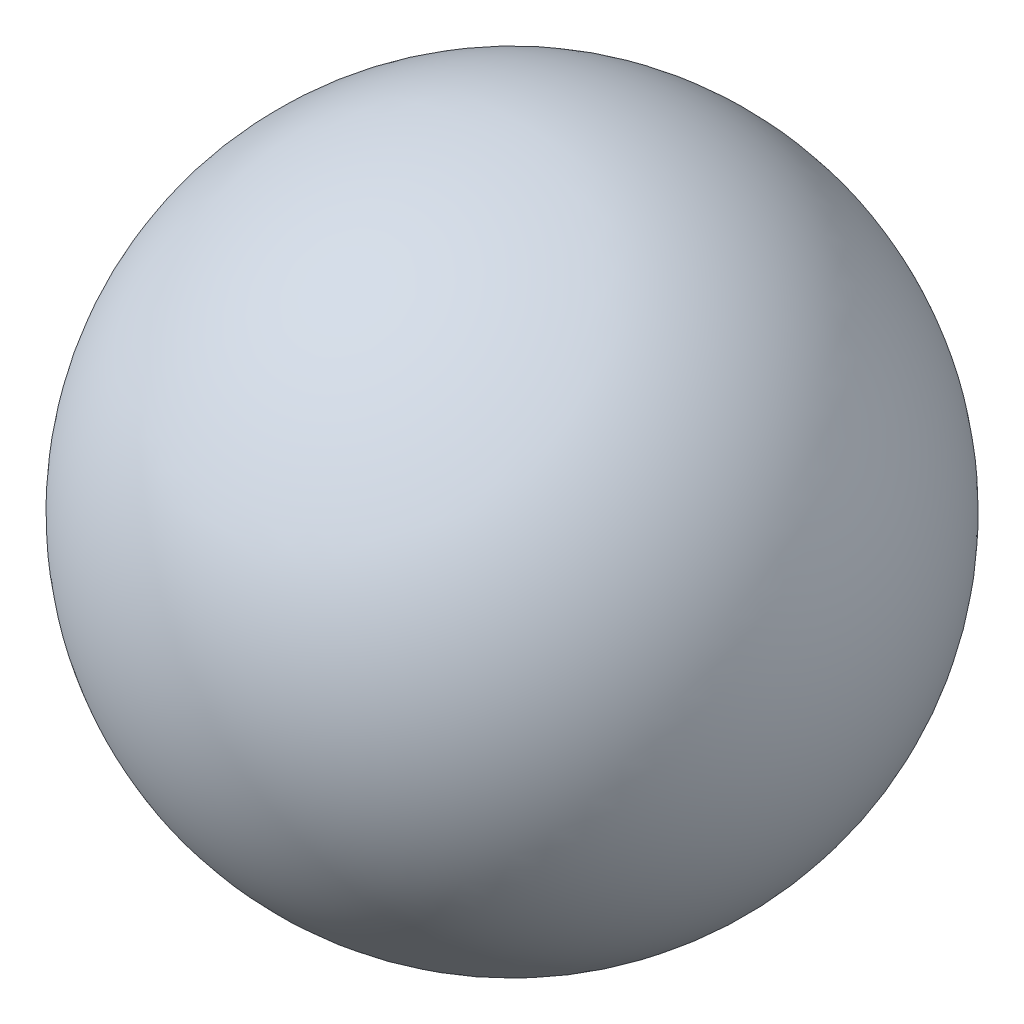
ISO-10303-21;
HEADER;
FILE_DESCRIPTION(('STEP AP214'),'2;1');
FILE_NAME('part.step','',(''),(''),'','','');
FILE_SCHEMA(('AUTOMOTIVE_DESIGN { 1 0 10303 214 1 1 1 1 }'));
ENDSEC;
DATA;
#1=APPLICATION_CONTEXT('core data for automotive mechanical design processes');
#2=APPLICATION_PROTOCOL_DEFINITION('international standard','automotive_design',2000,#1);
#3=PRODUCT_CONTEXT('',#1,'mechanical');
#4=PRODUCT('Part','Part','',(#3));
#5=PRODUCT_RELATED_PRODUCT_CATEGORY('part','',(#4));
#6=PRODUCT_DEFINITION_FORMATION('','',#4);
#7=PRODUCT_DEFINITION_CONTEXT('part definition',#1,'design');
#8=PRODUCT_DEFINITION('design','',#6,#7);
#9=PRODUCT_DEFINITION_SHAPE('','',#8);
#10=(LENGTH_UNIT() NAMED_UNIT(*) SI_UNIT(.MILLI.,.METRE.));
#11=(NAMED_UNIT(*) PLANE_ANGLE_UNIT() SI_UNIT($,.RADIAN.));
#12=(NAMED_UNIT(*) SI_UNIT($,.STERADIAN.) SOLID_ANGLE_UNIT());
#13=UNCERTAINTY_MEASURE_WITH_UNIT(LENGTH_MEASURE(1.E-05),#10,'distance_accuracy_value','');
#14=(GEOMETRIC_REPRESENTATION_CONTEXT(3) GLOBAL_UNCERTAINTY_ASSIGNED_CONTEXT((#13)) GLOBAL_UNIT_ASSIGNED_CONTEXT((#10,
#11,#12)) REPRESENTATION_CONTEXT('',''));
#15=CARTESIAN_POINT('',(0.,0.,0.));
#16=DIRECTION('',(0.,0.,1.));
#17=DIRECTION('',(1.,0.,0.));
#18=AXIS2_PLACEMENT_3D('',#15,#16,#17);
#19=CARTESIAN_POINT('',(0.,0.,0.));
#20=DIRECTION('',(0.,0.,1.));
#21=DIRECTION('',(-1.,0.,0.));
#22=AXIS2_PLACEMENT_3D('',#19,#20,#21);
#23=SPHERICAL_SURFACE('',#22,60.);
#24=CARTESIAN_POINT('',(0.,0.,60.));
#25=VERTEX_POINT('',#24);
#26=VERTEX_LOOP('',#25);
#27=FACE_BOUND('',#26,.T.);
#28=ADVANCED_FACE('F12',(#27),#23,.T.);
#29=CLOSED_SHELL('',(#28));
#30=CARTESIAN_POINT('',(0.,0.,0.));
#31=DIRECTION('',(0.,0.,1.));
#32=DIRECTION('',(-1.,0.,0.));
#33=AXIS2_PLACEMENT_3D('',#30,#31,#32);
#34=SPHERICAL_SURFACE('',#33,55.);
#35=CARTESIAN_POINT('',(0.,0.,55.));
#36=VERTEX_POINT('',#35);
#37=VERTEX_LOOP('',#36);
#38=FACE_BOUND('',#37,.T.);
#39=ADVANCED_FACE('F27',(#38),#34,.F.);
#40=CLOSED_SHELL('',(#39));
#41=ORIENTED_CLOSED_SHELL('',*,#40,.T.);
#42=BREP_WITH_VOIDS('B1',#29,(#41));
#43=ADVANCED_BREP_SHAPE_REPRESENTATION('',(#18,#42),#14);
#44=SHAPE_DEFINITION_REPRESENTATION(#9,#43);
ENDSEC;
END-ISO-10303-21;
